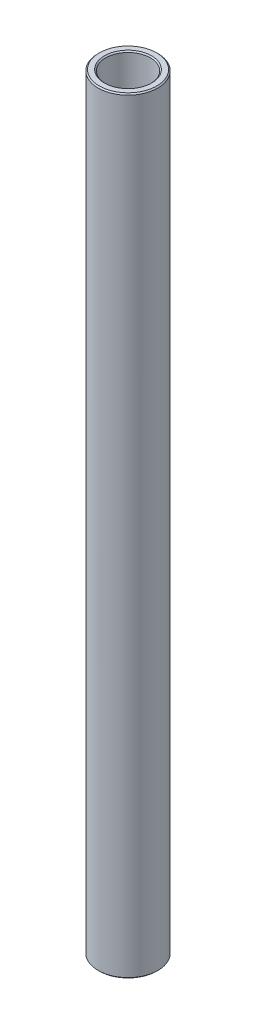
ISO-10303-21;
HEADER;
FILE_DESCRIPTION(('STEP AP214'),'2;1');
FILE_NAME('part.step','',(''),(''),'','','');
FILE_SCHEMA(('AUTOMOTIVE_DESIGN { 1 0 10303 214 1 1 1 1 }'));
ENDSEC;
DATA;
#1=APPLICATION_CONTEXT('core data for automotive mechanical design processes');
#2=APPLICATION_PROTOCOL_DEFINITION('international standard','automotive_design',2000,#1);
#3=PRODUCT_CONTEXT('',#1,'mechanical');
#4=PRODUCT('Part','Part','',(#3));
#5=PRODUCT_RELATED_PRODUCT_CATEGORY('part','',(#4));
#6=PRODUCT_DEFINITION_FORMATION('','',#4);
#7=PRODUCT_DEFINITION_CONTEXT('part definition',#1,'design');
#8=PRODUCT_DEFINITION('design','',#6,#7);
#9=PRODUCT_DEFINITION_SHAPE('','',#8);
#10=(LENGTH_UNIT() NAMED_UNIT(*) SI_UNIT(.MILLI.,.METRE.));
#11=(NAMED_UNIT(*) PLANE_ANGLE_UNIT() SI_UNIT($,.RADIAN.));
#12=(NAMED_UNIT(*) SI_UNIT($,.STERADIAN.) SOLID_ANGLE_UNIT());
#13=UNCERTAINTY_MEASURE_WITH_UNIT(LENGTH_MEASURE(1.E-05),#10,'distance_accuracy_value','');
#14=(GEOMETRIC_REPRESENTATION_CONTEXT(3) GLOBAL_UNCERTAINTY_ASSIGNED_CONTEXT((#13)) GLOBAL_UNIT_ASSIGNED_CONTEXT((#10,
#11,#12)) REPRESENTATION_CONTEXT('',''));
#15=CARTESIAN_POINT('',(0.,0.,0.));
#16=DIRECTION('',(0.,0.,1.));
#17=DIRECTION('',(1.,0.,0.));
#18=AXIS2_PLACEMENT_3D('',#15,#16,#17);
#19=CARTESIAN_POINT('',(6.35000000000029,131.762389929628,0.));
#20=DIRECTION('',(0.,-1.,0.));
#21=DIRECTION('',(1.,0.,0.));
#22=AXIS2_PLACEMENT_3D('',#19,#20,#21);
#23=PLANE('',#22);
#24=CARTESIAN_POINT('',(0.,131.762389929628,0.));
#25=DIRECTION('',(0.,-1.,0.));
#26=DIRECTION('',(1.,0.,0.));
#27=AXIS2_PLACEMENT_3D('',#24,#25,#26);
#28=CIRCLE('',#27,5.01650000000007);
#29=CARTESIAN_POINT('',(5.01649999999999,131.762389929628,0.));
#30=VERTEX_POINT('',#29);
#31=EDGE_CURVE('E10',#30,#30,#28,.F.);
#32=ORIENTED_EDGE('',*,*,#31,.T.);
#33=EDGE_LOOP('',(#32));
#34=FACE_BOUND('',#33,.T.);
#35=CARTESIAN_POINT('',(0.,131.762389929628,0.));
#36=DIRECTION('',(0.,-1.,0.));
#37=DIRECTION('',(1.,0.,0.));
#38=AXIS2_PLACEMENT_3D('',#35,#36,#37);
#39=CIRCLE('',#38,6.09600000000033);
#40=CARTESIAN_POINT('',(6.09600000000024,131.762389929628,0.));
#41=VERTEX_POINT('',#40);
#42=EDGE_CURVE('E38',#41,#41,#39,.T.);
#43=ORIENTED_EDGE('',*,*,#42,.T.);
#44=EDGE_LOOP('',(#43));
#45=FACE_BOUND('',#44,.T.);
#46=ADVANCED_FACE('F31',(#34,#45),#23,.T.);
#47=CARTESIAN_POINT('',(0.,122.237389929628,0.));
#48=DIRECTION('',(0.,-1.,0.));
#49=DIRECTION('',(1.,0.,0.));
#50=AXIS2_PLACEMENT_3D('',#47,#48,#49);
#51=CYLINDRICAL_SURFACE('',#50,4.76250000000079);
#52=CARTESIAN_POINT('',(-1.47075136937148E-12,294.357169005978,0.));
#53=DIRECTION('',(0.,1.,0.));
#54=DIRECTION('',(-1.,0.,0.));
#55=AXIS2_PLACEMENT_3D('',#52,#53,#54);
#56=CIRCLE('',#55,4.76250000000079);
#57=CARTESIAN_POINT('',(-4.76250000000226,294.357169005978,0.));
#58=VERTEX_POINT('',#57);
#59=EDGE_CURVE('E42',#58,#58,#56,.T.);
#60=ORIENTED_EDGE('',*,*,#59,.T.);
#61=EDGE_LOOP('',(#60));
#62=FACE_BOUND('',#61,.T.);
#63=CARTESIAN_POINT('',(0.,132.016389929627,0.));
#64=DIRECTION('',(0.,-1.,0.));
#65=DIRECTION('',(1.,0.,0.));
#66=AXIS2_PLACEMENT_3D('',#63,#64,#65);
#67=CIRCLE('',#66,4.76250000000079);
#68=CARTESIAN_POINT('',(4.76250000000071,132.016389929627,0.));
#69=VERTEX_POINT('',#68);
#70=EDGE_CURVE('E46',#69,#69,#67,.T.);
#71=ORIENTED_EDGE('',*,*,#70,.T.);
#72=EDGE_LOOP('',(#71));
#73=FACE_BOUND('',#72,.T.);
#74=ADVANCED_FACE('F75',(#62,#73),#51,.F.);
#75=CARTESIAN_POINT('',(4.76250000000001,294.611169005978,0.));
#76=DIRECTION('',(0.,1.,0.));
#77=DIRECTION('',(-1.,0.,0.));
#78=AXIS2_PLACEMENT_3D('',#75,#76,#77);
#79=PLANE('',#78);
#80=CARTESIAN_POINT('',(-1.4729217814521E-12,294.611169005978,0.));
#81=DIRECTION('',(0.,1.,0.));
#82=DIRECTION('',(-1.,0.,0.));
#83=AXIS2_PLACEMENT_3D('',#80,#81,#82);
#84=CIRCLE('',#83,6.09600000000171);
#85=CARTESIAN_POINT('',(-6.09600000000319,294.611169005978,0.));
#86=VERTEX_POINT('',#85);
#87=EDGE_CURVE('E51',#86,#86,#84,.T.);
#88=ORIENTED_EDGE('',*,*,#87,.T.);
#89=EDGE_LOOP('',(#88));
#90=FACE_BOUND('',#89,.T.);
#91=CARTESIAN_POINT('',(-1.4729217814521E-12,294.611169005978,0.));
#92=DIRECTION('',(0.,1.,0.));
#93=DIRECTION('',(-1.,0.,0.));
#94=AXIS2_PLACEMENT_3D('',#91,#92,#93);
#95=CIRCLE('',#94,5.01650000000144);
#96=CARTESIAN_POINT('',(-5.01650000000291,294.611169005978,0.));
#97=VERTEX_POINT('',#96);
#98=EDGE_CURVE('E54',#97,#97,#95,.F.);
#99=ORIENTED_EDGE('',*,*,#98,.T.);
#100=EDGE_LOOP('',(#99));
#101=FACE_BOUND('',#100,.T.);
#102=ADVANCED_FACE('F80',(#90,#101),#79,.T.);
#103=CARTESIAN_POINT('',(0.,122.237389929628,0.));
#104=DIRECTION('',(0.,-1.,0.));
#105=DIRECTION('',(1.,0.,0.));
#106=AXIS2_PLACEMENT_3D('',#103,#104,#105);
#107=CYLINDRICAL_SURFACE('',#106,6.35000000000106);
#108=CARTESIAN_POINT('',(-1.47075136937149E-12,294.357169005979,0.));
#109=DIRECTION('',(0.,1.,0.));
#110=DIRECTION('',(-1.,0.,0.));
#111=AXIS2_PLACEMENT_3D('',#108,#109,#110);
#112=CIRCLE('',#111,6.35000000000106);
#113=CARTESIAN_POINT('',(-6.35000000000253,294.357169005979,0.));
#114=VERTEX_POINT('',#113);
#115=EDGE_CURVE('E57',#114,#114,#112,.F.);
#116=ORIENTED_EDGE('',*,*,#115,.T.);
#117=EDGE_LOOP('',(#116));
#118=FACE_BOUND('',#117,.T.);
#119=CARTESIAN_POINT('',(0.,132.016389929628,0.));
#120=DIRECTION('',(0.,-1.,0.));
#121=DIRECTION('',(1.,0.,0.));
#122=AXIS2_PLACEMENT_3D('',#119,#120,#121);
#123=CIRCLE('',#122,6.35000000000106);
#124=CARTESIAN_POINT('',(6.35000000000098,132.016389929629,0.));
#125=VERTEX_POINT('',#124);
#126=EDGE_CURVE('E60',#125,#125,#123,.F.);
#127=ORIENTED_EDGE('',*,*,#126,.T.);
#128=EDGE_LOOP('',(#127));
#129=FACE_BOUND('',#128,.T.);
#130=ADVANCED_FACE('F64',(#118,#129),#107,.T.);
#131=CARTESIAN_POINT('',(-1.47075136937149E-12,294.357169005979,0.));
#132=DIRECTION('',(0.,-1.,0.));
#133=DIRECTION('',(1.,0.,0.));
#134=AXIS2_PLACEMENT_3D('',#131,#132,#133);
#135=CONICAL_SURFACE('',#134,6.35000000000106,0.785398163397382);
#136=ORIENTED_EDGE('',*,*,#87,.F.);
#137=EDGE_LOOP('',(#136));
#138=FACE_BOUND('',#137,.T.);
#139=ORIENTED_EDGE('',*,*,#115,.F.);
#140=EDGE_LOOP('',(#139));
#141=FACE_BOUND('',#140,.T.);
#142=ADVANCED_FACE('F85',(#138,#141),#135,.T.);
#143=CARTESIAN_POINT('',(-1.4729217814521E-12,294.611169005978,0.));
#144=DIRECTION('',(0.,1.,0.));
#145=DIRECTION('',(-1.,0.,0.));
#146=AXIS2_PLACEMENT_3D('',#143,#144,#145);
#147=CONICAL_SURFACE('',#146,5.01650000000148,0.785398163397318);
#148=ORIENTED_EDGE('',*,*,#59,.F.);
#149=EDGE_LOOP('',(#148));
#150=FACE_BOUND('',#149,.T.);
#151=ORIENTED_EDGE('',*,*,#98,.F.);
#152=EDGE_LOOP('',(#151));
#153=FACE_BOUND('',#152,.T.);
#154=ADVANCED_FACE('F72',(#150,#153),#147,.F.);
#155=CARTESIAN_POINT('',(0.,132.016389929627,0.));
#156=DIRECTION('',(0.,-1.,0.));
#157=DIRECTION('',(1.,0.,0.));
#158=AXIS2_PLACEMENT_3D('',#155,#156,#157);
#159=CONICAL_SURFACE('',#158,4.76250000000079,0.785398163397397);
#160=ORIENTED_EDGE('',*,*,#31,.F.);
#161=EDGE_LOOP('',(#160));
#162=FACE_BOUND('',#161,.T.);
#163=ORIENTED_EDGE('',*,*,#70,.F.);
#164=EDGE_LOOP('',(#163));
#165=FACE_BOUND('',#164,.T.);
#166=ADVANCED_FACE('F68',(#162,#165),#159,.F.);
#167=CARTESIAN_POINT('',(0.,131.762389929628,0.));
#168=DIRECTION('',(0.,1.,0.));
#169=DIRECTION('',(-1.,0.,0.));
#170=AXIS2_PLACEMENT_3D('',#167,#168,#169);
#171=CONICAL_SURFACE('',#170,6.09600000000033,0.78539816339747);
#172=ORIENTED_EDGE('',*,*,#126,.F.);
#173=EDGE_LOOP('',(#172));
#174=FACE_BOUND('',#173,.T.);
#175=ORIENTED_EDGE('',*,*,#42,.F.);
#176=EDGE_LOOP('',(#175));
#177=FACE_BOUND('',#176,.T.);
#178=ADVANCED_FACE('F33',(#174,#177),#171,.T.);
#179=CLOSED_SHELL('',(#46,#74,#102,#130,#142,#154,#166,#178));
#180=MANIFOLD_SOLID_BREP('B2',#179);
#181=ADVANCED_BREP_SHAPE_REPRESENTATION('',(#18,#180),#14);
#182=SHAPE_DEFINITION_REPRESENTATION(#9,#181);
ENDSEC;
END-ISO-10303-21;
